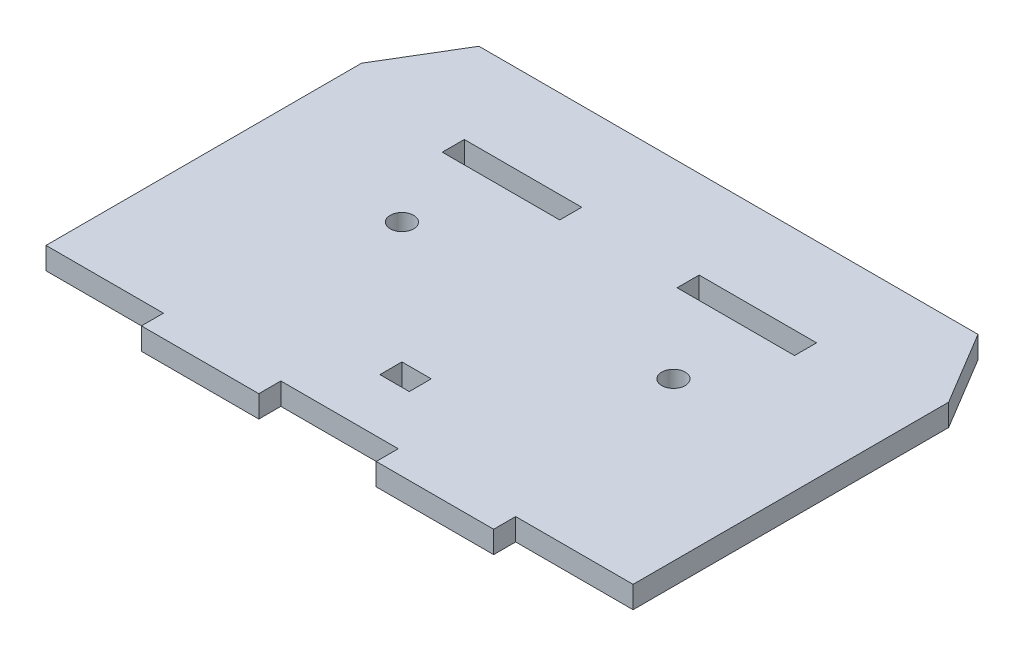
ISO-10303-21;
HEADER;
FILE_DESCRIPTION(('STEP AP214'),'2;1');
FILE_NAME('part.step','',(''),(''),'','','');
FILE_SCHEMA(('AUTOMOTIVE_DESIGN { 1 0 10303 214 1 1 1 1 }'));
ENDSEC;
DATA;
#1=APPLICATION_CONTEXT('core data for automotive mechanical design processes');
#2=APPLICATION_PROTOCOL_DEFINITION('international standard','automotive_design',2000,#1);
#3=PRODUCT_CONTEXT('',#1,'mechanical');
#4=PRODUCT('Part','Part','',(#3));
#5=PRODUCT_RELATED_PRODUCT_CATEGORY('part','',(#4));
#6=PRODUCT_DEFINITION_FORMATION('','',#4);
#7=PRODUCT_DEFINITION_CONTEXT('part definition',#1,'design');
#8=PRODUCT_DEFINITION('design','',#6,#7);
#9=PRODUCT_DEFINITION_SHAPE('','',#8);
#10=(LENGTH_UNIT() NAMED_UNIT(*) SI_UNIT(.MILLI.,.METRE.));
#11=(NAMED_UNIT(*) PLANE_ANGLE_UNIT() SI_UNIT($,.RADIAN.));
#12=(NAMED_UNIT(*) SI_UNIT($,.STERADIAN.) SOLID_ANGLE_UNIT());
#13=UNCERTAINTY_MEASURE_WITH_UNIT(LENGTH_MEASURE(1.E-05),#10,'distance_accuracy_value','');
#14=(GEOMETRIC_REPRESENTATION_CONTEXT(3) GLOBAL_UNCERTAINTY_ASSIGNED_CONTEXT((#13)) GLOBAL_UNIT_ASSIGNED_CONTEXT((#10,
#11,#12)) REPRESENTATION_CONTEXT('',''));
#15=CARTESIAN_POINT('',(0.,0.,0.));
#16=DIRECTION('',(0.,0.,1.));
#17=DIRECTION('',(1.,0.,0.));
#18=AXIS2_PLACEMENT_3D('',#15,#16,#17);
#19=CARTESIAN_POINT('',(-34.,3.,-47.));
#20=DIRECTION('',(0.,0.,1.));
#21=DIRECTION('',(1.,0.,0.));
#22=AXIS2_PLACEMENT_3D('',#19,#20,#21);
#23=PLANE('',#22);
#24=DIRECTION('',(-1.,0.,0.));
#25=VECTOR('',#24,1.);
#26=CARTESIAN_POINT('',(-34.,0.,-47.));
#27=LINE('',#26,#25);
#28=CARTESIAN_POINT('',(34.,0.,-47.));
#29=VERTEX_POINT('',#28);
#30=CARTESIAN_POINT('',(-34.,0.,-47.));
#31=VERTEX_POINT('',#30);
#32=EDGE_CURVE('E242',#29,#31,#27,.T.);
#33=ORIENTED_EDGE('',*,*,#32,.T.);
#34=DIRECTION('',(0.,-1.,0.));
#35=VECTOR('',#34,1.);
#36=CARTESIAN_POINT('',(-34.,3.,-47.));
#37=LINE('',#36,#35);
#38=CARTESIAN_POINT('',(-34.,3.,-47.));
#39=VERTEX_POINT('',#38);
#40=EDGE_CURVE('E11',#39,#31,#37,.T.);
#41=ORIENTED_EDGE('',*,*,#40,.F.);
#42=DIRECTION('',(-1.,0.,0.));
#43=VECTOR('',#42,1.);
#44=CARTESIAN_POINT('',(-34.,3.,-47.));
#45=LINE('',#44,#43);
#46=CARTESIAN_POINT('',(34.,3.,-47.));
#47=VERTEX_POINT('',#46);
#48=EDGE_CURVE('E319',#47,#39,#45,.T.);
#49=ORIENTED_EDGE('',*,*,#48,.F.);
#50=DIRECTION('',(0.,-1.,0.));
#51=VECTOR('',#50,1.);
#52=CARTESIAN_POINT('',(34.,3.,-47.));
#53=LINE('',#52,#51);
#54=EDGE_CURVE('E349',#47,#29,#53,.T.);
#55=ORIENTED_EDGE('',*,*,#54,.T.);
#56=EDGE_LOOP('',(#33,#41,#49,#55));
#57=FACE_BOUND('',#56,.T.);
#58=ADVANCED_FACE('F33',(#57),#23,.F.);
#59=CARTESIAN_POINT('',(-40.,3.,-37.));
#60=DIRECTION('',(0.857492925712545,0.,0.514495755427526));
#61=DIRECTION('',(0.514495755427526,0.,-0.857492925712545));
#62=AXIS2_PLACEMENT_3D('',#59,#60,#61);
#63=PLANE('',#62);
#64=DIRECTION('',(-0.514495755427526,0.,0.857492925712544));
#65=VECTOR('',#64,1.);
#66=CARTESIAN_POINT('',(-40.,0.,-37.));
#67=LINE('',#66,#65);
#68=CARTESIAN_POINT('',(-40.,0.,-37.));
#69=VERTEX_POINT('',#68);
#70=EDGE_CURVE('E352',#31,#69,#67,.T.);
#71=ORIENTED_EDGE('',*,*,#70,.T.);
#72=DIRECTION('',(0.,-1.,0.));
#73=VECTOR('',#72,1.);
#74=CARTESIAN_POINT('',(-40.,3.,-37.));
#75=LINE('',#74,#73);
#76=CARTESIAN_POINT('',(-40.,3.,-37.));
#77=VERTEX_POINT('',#76);
#78=EDGE_CURVE('E40',#77,#69,#75,.T.);
#79=ORIENTED_EDGE('',*,*,#78,.F.);
#80=DIRECTION('',(-0.514495755427526,0.,0.857492925712544));
#81=VECTOR('',#80,1.);
#82=CARTESIAN_POINT('',(-40.,3.,-37.));
#83=LINE('',#82,#81);
#84=EDGE_CURVE('E322',#39,#77,#83,.T.);
#85=ORIENTED_EDGE('',*,*,#84,.F.);
#86=ORIENTED_EDGE('',*,*,#40,.T.);
#87=EDGE_LOOP('',(#71,#79,#85,#86));
#88=FACE_BOUND('',#87,.T.);
#89=ADVANCED_FACE('F438',(#88),#63,.F.);
#90=CARTESIAN_POINT('',(-40.,3.,-37.));
#91=DIRECTION('',(1.,0.,0.));
#92=DIRECTION('',(0.,0.,-1.));
#93=AXIS2_PLACEMENT_3D('',#90,#91,#92);
#94=PLANE('',#93);
#95=DIRECTION('',(0.,0.,1.));
#96=VECTOR('',#95,1.);
#97=CARTESIAN_POINT('',(-40.,0.,-37.));
#98=LINE('',#97,#96);
#99=CARTESIAN_POINT('',(-40.,0.,6.));
#100=VERTEX_POINT('',#99);
#101=EDGE_CURVE('E354',#69,#100,#98,.T.);
#102=ORIENTED_EDGE('',*,*,#101,.T.);
#103=DIRECTION('',(0.,-1.,0.));
#104=VECTOR('',#103,1.);
#105=CARTESIAN_POINT('',(-40.,3.,6.));
#106=LINE('',#105,#104);
#107=CARTESIAN_POINT('',(-40.,3.,6.));
#108=VERTEX_POINT('',#107);
#109=EDGE_CURVE('E409',#108,#100,#106,.T.);
#110=ORIENTED_EDGE('',*,*,#109,.F.);
#111=DIRECTION('',(0.,0.,1.));
#112=VECTOR('',#111,1.);
#113=CARTESIAN_POINT('',(-40.,3.,-37.));
#114=LINE('',#113,#112);
#115=EDGE_CURVE('E325',#77,#108,#114,.T.);
#116=ORIENTED_EDGE('',*,*,#115,.F.);
#117=ORIENTED_EDGE('',*,*,#78,.T.);
#118=EDGE_LOOP('',(#102,#110,#116,#117));
#119=FACE_BOUND('',#118,.T.);
#120=ADVANCED_FACE('F416',(#119),#94,.F.);
#121=CARTESIAN_POINT('',(-40.,3.,6.));
#122=DIRECTION('',(0.,0.,-1.));
#123=DIRECTION('',(-1.,0.,0.));
#124=AXIS2_PLACEMENT_3D('',#121,#122,#123);
#125=PLANE('',#124);
#126=DIRECTION('',(1.,0.,0.));
#127=VECTOR('',#126,1.);
#128=CARTESIAN_POINT('',(-40.,0.,6.));
#129=LINE('',#128,#127);
#130=CARTESIAN_POINT('',(-24.,0.,6.));
#131=VERTEX_POINT('',#130);
#132=EDGE_CURVE('E356',#100,#131,#129,.T.);
#133=ORIENTED_EDGE('',*,*,#132,.T.);
#134=DIRECTION('',(0.,-1.,0.));
#135=VECTOR('',#134,1.);
#136=CARTESIAN_POINT('',(-24.,3.,6.));
#137=LINE('',#136,#135);
#138=CARTESIAN_POINT('',(-24.,3.,6.));
#139=VERTEX_POINT('',#138);
#140=EDGE_CURVE('E406',#139,#131,#137,.T.);
#141=ORIENTED_EDGE('',*,*,#140,.F.);
#142=DIRECTION('',(1.,0.,0.));
#143=VECTOR('',#142,1.);
#144=CARTESIAN_POINT('',(-40.,3.,6.));
#145=LINE('',#144,#143);
#146=EDGE_CURVE('E327',#108,#139,#145,.T.);
#147=ORIENTED_EDGE('',*,*,#146,.F.);
#148=ORIENTED_EDGE('',*,*,#109,.T.);
#149=EDGE_LOOP('',(#133,#141,#147,#148));
#150=FACE_BOUND('',#149,.T.);
#151=ADVANCED_FACE('F426',(#150),#125,.F.);
#152=CARTESIAN_POINT('',(-24.,3.,6.));
#153=DIRECTION('',(1.,0.,0.));
#154=DIRECTION('',(0.,0.,-1.));
#155=AXIS2_PLACEMENT_3D('',#152,#153,#154);
#156=PLANE('',#155);
#157=DIRECTION('',(0.,0.,1.));
#158=VECTOR('',#157,1.);
#159=CARTESIAN_POINT('',(-24.,0.,6.));
#160=LINE('',#159,#158);
#161=CARTESIAN_POINT('',(-24.,0.,9.));
#162=VERTEX_POINT('',#161);
#163=EDGE_CURVE('E358',#131,#162,#160,.T.);
#164=ORIENTED_EDGE('',*,*,#163,.T.);
#165=DIRECTION('',(0.,-1.,0.));
#166=VECTOR('',#165,1.);
#167=CARTESIAN_POINT('',(-24.,3.,9.));
#168=LINE('',#167,#166);
#169=CARTESIAN_POINT('',(-24.,3.,9.));
#170=VERTEX_POINT('',#169);
#171=EDGE_CURVE('E403',#170,#162,#168,.T.);
#172=ORIENTED_EDGE('',*,*,#171,.F.);
#173=DIRECTION('',(0.,0.,1.));
#174=VECTOR('',#173,1.);
#175=CARTESIAN_POINT('',(-24.,3.,6.));
#176=LINE('',#175,#174);
#177=EDGE_CURVE('E329',#139,#170,#176,.T.);
#178=ORIENTED_EDGE('',*,*,#177,.F.);
#179=ORIENTED_EDGE('',*,*,#140,.T.);
#180=EDGE_LOOP('',(#164,#172,#178,#179));
#181=FACE_BOUND('',#180,.T.);
#182=ADVANCED_FACE('F430',(#181),#156,.F.);
#183=CARTESIAN_POINT('',(-24.,3.,9.));
#184=DIRECTION('',(0.,0.,-1.));
#185=DIRECTION('',(-1.,0.,0.));
#186=AXIS2_PLACEMENT_3D('',#183,#184,#185);
#187=PLANE('',#186);
#188=DIRECTION('',(1.,0.,0.));
#189=VECTOR('',#188,1.);
#190=CARTESIAN_POINT('',(-24.,0.,9.));
#191=LINE('',#190,#189);
#192=CARTESIAN_POINT('',(-8.,0.,8.99999999999999));
#193=VERTEX_POINT('',#192);
#194=EDGE_CURVE('E360',#162,#193,#191,.T.);
#195=ORIENTED_EDGE('',*,*,#194,.T.);
#196=DIRECTION('',(0.,-1.,0.));
#197=VECTOR('',#196,1.);
#198=CARTESIAN_POINT('',(-8.,3.,8.99999999999999));
#199=LINE('',#198,#197);
#200=CARTESIAN_POINT('',(-8.,3.,8.99999999999999));
#201=VERTEX_POINT('',#200);
#202=EDGE_CURVE('E400',#201,#193,#199,.T.);
#203=ORIENTED_EDGE('',*,*,#202,.F.);
#204=DIRECTION('',(1.,0.,0.));
#205=VECTOR('',#204,1.);
#206=CARTESIAN_POINT('',(-24.,3.,9.));
#207=LINE('',#206,#205);
#208=EDGE_CURVE('E331',#170,#201,#207,.T.);
#209=ORIENTED_EDGE('',*,*,#208,.F.);
#210=ORIENTED_EDGE('',*,*,#171,.T.);
#211=EDGE_LOOP('',(#195,#203,#209,#210));
#212=FACE_BOUND('',#211,.T.);
#213=ADVANCED_FACE('F481',(#212),#187,.F.);
#214=CARTESIAN_POINT('',(-8.,3.,8.99999999999999));
#215=DIRECTION('',(-1.,0.,0.));
#216=DIRECTION('',(0.,0.,1.));
#217=AXIS2_PLACEMENT_3D('',#214,#215,#216);
#218=PLANE('',#217);
#219=DIRECTION('',(0.,0.,-1.));
#220=VECTOR('',#219,1.);
#221=CARTESIAN_POINT('',(-8.,0.,8.99999999999999));
#222=LINE('',#221,#220);
#223=CARTESIAN_POINT('',(-8.,0.,6.));
#224=VERTEX_POINT('',#223);
#225=EDGE_CURVE('E362',#193,#224,#222,.T.);
#226=ORIENTED_EDGE('',*,*,#225,.T.);
#227=DIRECTION('',(0.,-1.,0.));
#228=VECTOR('',#227,1.);
#229=CARTESIAN_POINT('',(-8.,3.,6.));
#230=LINE('',#229,#228);
#231=CARTESIAN_POINT('',(-8.,3.,6.));
#232=VERTEX_POINT('',#231);
#233=EDGE_CURVE('E397',#232,#224,#230,.T.);
#234=ORIENTED_EDGE('',*,*,#233,.F.);
#235=DIRECTION('',(0.,0.,-1.));
#236=VECTOR('',#235,1.);
#237=CARTESIAN_POINT('',(-8.,3.,8.99999999999999));
#238=LINE('',#237,#236);
#239=EDGE_CURVE('E333',#201,#232,#238,.T.);
#240=ORIENTED_EDGE('',*,*,#239,.F.);
#241=ORIENTED_EDGE('',*,*,#202,.T.);
#242=EDGE_LOOP('',(#226,#234,#240,#241));
#243=FACE_BOUND('',#242,.T.);
#244=ADVANCED_FACE('F479',(#243),#218,.F.);
#245=CARTESIAN_POINT('',(-8.,3.,6.));
#246=DIRECTION('',(0.,0.,-1.));
#247=DIRECTION('',(-1.,0.,0.));
#248=AXIS2_PLACEMENT_3D('',#245,#246,#247);
#249=PLANE('',#248);
#250=DIRECTION('',(1.,0.,0.));
#251=VECTOR('',#250,1.);
#252=CARTESIAN_POINT('',(-8.,0.,6.));
#253=LINE('',#252,#251);
#254=CARTESIAN_POINT('',(8.,0.,6.));
#255=VERTEX_POINT('',#254);
#256=EDGE_CURVE('E364',#224,#255,#253,.T.);
#257=ORIENTED_EDGE('',*,*,#256,.T.);
#258=DIRECTION('',(0.,-1.,0.));
#259=VECTOR('',#258,1.);
#260=CARTESIAN_POINT('',(8.,3.,6.));
#261=LINE('',#260,#259);
#262=CARTESIAN_POINT('',(8.,3.,6.));
#263=VERTEX_POINT('',#262);
#264=EDGE_CURVE('E394',#263,#255,#261,.T.);
#265=ORIENTED_EDGE('',*,*,#264,.F.);
#266=DIRECTION('',(1.,0.,0.));
#267=VECTOR('',#266,1.);
#268=CARTESIAN_POINT('',(-8.,3.,6.));
#269=LINE('',#268,#267);
#270=EDGE_CURVE('E335',#232,#263,#269,.T.);
#271=ORIENTED_EDGE('',*,*,#270,.F.);
#272=ORIENTED_EDGE('',*,*,#233,.T.);
#273=EDGE_LOOP('',(#257,#265,#271,#272));
#274=FACE_BOUND('',#273,.T.);
#275=ADVANCED_FACE('F474',(#274),#249,.F.);
#276=CARTESIAN_POINT('',(8.,3.,6.));
#277=DIRECTION('',(1.,0.,0.));
#278=DIRECTION('',(0.,0.,-1.));
#279=AXIS2_PLACEMENT_3D('',#276,#277,#278);
#280=PLANE('',#279);
#281=DIRECTION('',(0.,0.,1.));
#282=VECTOR('',#281,1.);
#283=CARTESIAN_POINT('',(8.,0.,6.));
#284=LINE('',#283,#282);
#285=CARTESIAN_POINT('',(8.,0.,9.));
#286=VERTEX_POINT('',#285);
#287=EDGE_CURVE('E366',#255,#286,#284,.T.);
#288=ORIENTED_EDGE('',*,*,#287,.T.);
#289=DIRECTION('',(0.,-1.,0.));
#290=VECTOR('',#289,1.);
#291=CARTESIAN_POINT('',(8.,3.,9.));
#292=LINE('',#291,#290);
#293=CARTESIAN_POINT('',(8.,3.,9.));
#294=VERTEX_POINT('',#293);
#295=EDGE_CURVE('E391',#294,#286,#292,.T.);
#296=ORIENTED_EDGE('',*,*,#295,.F.);
#297=DIRECTION('',(0.,0.,1.));
#298=VECTOR('',#297,1.);
#299=CARTESIAN_POINT('',(8.,3.,6.));
#300=LINE('',#299,#298);
#301=EDGE_CURVE('E337',#263,#294,#300,.T.);
#302=ORIENTED_EDGE('',*,*,#301,.F.);
#303=ORIENTED_EDGE('',*,*,#264,.T.);
#304=EDGE_LOOP('',(#288,#296,#302,#303));
#305=FACE_BOUND('',#304,.T.);
#306=ADVANCED_FACE('F469',(#305),#280,.F.);
#307=CARTESIAN_POINT('',(8.,3.,9.));
#308=DIRECTION('',(0.,0.,-1.));
#309=DIRECTION('',(-1.,0.,0.));
#310=AXIS2_PLACEMENT_3D('',#307,#308,#309);
#311=PLANE('',#310);
#312=DIRECTION('',(1.,0.,0.));
#313=VECTOR('',#312,1.);
#314=CARTESIAN_POINT('',(8.,0.,9.));
#315=LINE('',#314,#313);
#316=CARTESIAN_POINT('',(24.,0.,8.99999999999999));
#317=VERTEX_POINT('',#316);
#318=EDGE_CURVE('E368',#286,#317,#315,.T.);
#319=ORIENTED_EDGE('',*,*,#318,.T.);
#320=DIRECTION('',(0.,-1.,0.));
#321=VECTOR('',#320,1.);
#322=CARTESIAN_POINT('',(24.,3.,8.99999999999999));
#323=LINE('',#322,#321);
#324=CARTESIAN_POINT('',(24.,3.,8.99999999999999));
#325=VERTEX_POINT('',#324);
#326=EDGE_CURVE('E388',#325,#317,#323,.T.);
#327=ORIENTED_EDGE('',*,*,#326,.F.);
#328=DIRECTION('',(1.,0.,0.));
#329=VECTOR('',#328,1.);
#330=CARTESIAN_POINT('',(8.,3.,9.));
#331=LINE('',#330,#329);
#332=EDGE_CURVE('E339',#294,#325,#331,.T.);
#333=ORIENTED_EDGE('',*,*,#332,.F.);
#334=ORIENTED_EDGE('',*,*,#295,.T.);
#335=EDGE_LOOP('',(#319,#327,#333,#334));
#336=FACE_BOUND('',#335,.T.);
#337=ADVANCED_FACE('F465',(#336),#311,.F.);
#338=CARTESIAN_POINT('',(24.,3.,8.99999999999999));
#339=DIRECTION('',(-1.,0.,0.));
#340=DIRECTION('',(0.,0.,1.));
#341=AXIS2_PLACEMENT_3D('',#338,#339,#340);
#342=PLANE('',#341);
#343=DIRECTION('',(0.,0.,-1.));
#344=VECTOR('',#343,1.);
#345=CARTESIAN_POINT('',(24.,0.,8.99999999999999));
#346=LINE('',#345,#344);
#347=CARTESIAN_POINT('',(24.,0.,6.));
#348=VERTEX_POINT('',#347);
#349=EDGE_CURVE('E370',#317,#348,#346,.T.);
#350=ORIENTED_EDGE('',*,*,#349,.T.);
#351=DIRECTION('',(0.,-1.,0.));
#352=VECTOR('',#351,1.);
#353=CARTESIAN_POINT('',(24.,3.,6.));
#354=LINE('',#353,#352);
#355=CARTESIAN_POINT('',(24.,3.,6.));
#356=VERTEX_POINT('',#355);
#357=EDGE_CURVE('E385',#356,#348,#354,.T.);
#358=ORIENTED_EDGE('',*,*,#357,.F.);
#359=DIRECTION('',(0.,0.,-1.));
#360=VECTOR('',#359,1.);
#361=CARTESIAN_POINT('',(24.,3.,8.99999999999999));
#362=LINE('',#361,#360);
#363=EDGE_CURVE('E341',#325,#356,#362,.T.);
#364=ORIENTED_EDGE('',*,*,#363,.F.);
#365=ORIENTED_EDGE('',*,*,#326,.T.);
#366=EDGE_LOOP('',(#350,#358,#364,#365));
#367=FACE_BOUND('',#366,.T.);
#368=ADVANCED_FACE('F460',(#367),#342,.F.);
#369=CARTESIAN_POINT('',(24.,3.,6.));
#370=DIRECTION('',(0.,0.,-1.));
#371=DIRECTION('',(-1.,0.,0.));
#372=AXIS2_PLACEMENT_3D('',#369,#370,#371);
#373=PLANE('',#372);
#374=DIRECTION('',(1.,0.,0.));
#375=VECTOR('',#374,1.);
#376=CARTESIAN_POINT('',(24.,0.,6.));
#377=LINE('',#376,#375);
#378=CARTESIAN_POINT('',(40.,0.,6.));
#379=VERTEX_POINT('',#378);
#380=EDGE_CURVE('E372',#348,#379,#377,.T.);
#381=ORIENTED_EDGE('',*,*,#380,.T.);
#382=DIRECTION('',(0.,-1.,0.));
#383=VECTOR('',#382,1.);
#384=CARTESIAN_POINT('',(40.,3.,6.));
#385=LINE('',#384,#383);
#386=CARTESIAN_POINT('',(40.,3.,6.));
#387=VERTEX_POINT('',#386);
#388=EDGE_CURVE('E382',#387,#379,#385,.T.);
#389=ORIENTED_EDGE('',*,*,#388,.F.);
#390=DIRECTION('',(1.,0.,0.));
#391=VECTOR('',#390,1.);
#392=CARTESIAN_POINT('',(24.,3.,6.));
#393=LINE('',#392,#391);
#394=EDGE_CURVE('E343',#356,#387,#393,.T.);
#395=ORIENTED_EDGE('',*,*,#394,.F.);
#396=ORIENTED_EDGE('',*,*,#357,.T.);
#397=EDGE_LOOP('',(#381,#389,#395,#396));
#398=FACE_BOUND('',#397,.T.);
#399=ADVANCED_FACE('F454',(#398),#373,.F.);
#400=CARTESIAN_POINT('',(40.,3.,-37.));
#401=DIRECTION('',(-1.,0.,0.));
#402=DIRECTION('',(0.,0.,1.));
#403=AXIS2_PLACEMENT_3D('',#400,#401,#402);
#404=PLANE('',#403);
#405=DIRECTION('',(0.,0.,-1.));
#406=VECTOR('',#405,1.);
#407=CARTESIAN_POINT('',(40.,0.,-37.));
#408=LINE('',#407,#406);
#409=CARTESIAN_POINT('',(40.,0.,-37.));
#410=VERTEX_POINT('',#409);
#411=EDGE_CURVE('E374',#379,#410,#408,.T.);
#412=ORIENTED_EDGE('',*,*,#411,.T.);
#413=DIRECTION('',(0.,-1.,0.));
#414=VECTOR('',#413,1.);
#415=CARTESIAN_POINT('',(40.,3.,-37.));
#416=LINE('',#415,#414);
#417=CARTESIAN_POINT('',(40.,3.,-37.));
#418=VERTEX_POINT('',#417);
#419=EDGE_CURVE('E379',#418,#410,#416,.T.);
#420=ORIENTED_EDGE('',*,*,#419,.F.);
#421=DIRECTION('',(0.,0.,-1.));
#422=VECTOR('',#421,1.);
#423=CARTESIAN_POINT('',(40.,3.,-37.));
#424=LINE('',#423,#422);
#425=EDGE_CURVE('E345',#387,#418,#424,.T.);
#426=ORIENTED_EDGE('',*,*,#425,.F.);
#427=ORIENTED_EDGE('',*,*,#388,.T.);
#428=EDGE_LOOP('',(#412,#420,#426,#427));
#429=FACE_BOUND('',#428,.T.);
#430=ADVANCED_FACE('F450',(#429),#404,.F.);
#431=CARTESIAN_POINT('',(34.,3.,-47.));
#432=DIRECTION('',(-0.857492925712545,0.,0.514495755427526));
#433=DIRECTION('',(0.514495755427526,0.,0.857492925712545));
#434=AXIS2_PLACEMENT_3D('',#431,#432,#433);
#435=PLANE('',#434);
#436=DIRECTION('',(-0.514495755427526,0.,-0.857492925712544));
#437=VECTOR('',#436,1.);
#438=CARTESIAN_POINT('',(34.,0.,-47.));
#439=LINE('',#438,#437);
#440=EDGE_CURVE('E323',#410,#29,#439,.T.);
#441=ORIENTED_EDGE('',*,*,#440,.T.);
#442=ORIENTED_EDGE('',*,*,#54,.F.);
#443=DIRECTION('',(-0.514495755427526,0.,-0.857492925712544));
#444=VECTOR('',#443,1.);
#445=CARTESIAN_POINT('',(34.,3.,-47.));
#446=LINE('',#445,#444);
#447=EDGE_CURVE('E347',#418,#47,#446,.T.);
#448=ORIENTED_EDGE('',*,*,#447,.F.);
#449=ORIENTED_EDGE('',*,*,#419,.T.);
#450=EDGE_LOOP('',(#441,#442,#448,#449));
#451=FACE_BOUND('',#450,.T.);
#452=ADVANCED_FACE('F445',(#451),#435,.F.);
#453=CARTESIAN_POINT('',(0.,3.,0.));
#454=DIRECTION('',(0.,-1.,0.));
#455=DIRECTION('',(0.,0.,-1.));
#456=AXIS2_PLACEMENT_3D('',#453,#454,#455);
#457=PLANE('',#456);
#458=DIRECTION('',(-1.,0.,0.));
#459=VECTOR('',#458,1.);
#460=CARTESIAN_POINT('',(-2.,3.,-4.50000000000001));
#461=LINE('',#460,#459);
#462=CARTESIAN_POINT('',(2.,3.,-4.50000000000001));
#463=VERTEX_POINT('',#462);
#464=CARTESIAN_POINT('',(-2.,3.,-4.50000000000001));
#465=VERTEX_POINT('',#464);
#466=EDGE_CURVE('E235',#463,#465,#461,.T.);
#467=ORIENTED_EDGE('',*,*,#466,.F.);
#468=DIRECTION('',(0.,0.,-1.));
#469=VECTOR('',#468,1.);
#470=CARTESIAN_POINT('',(2.,3.,-4.50000000000001));
#471=LINE('',#470,#469);
#472=CARTESIAN_POINT('',(2.00000000000001,3.,-1.50000000000001));
#473=VERTEX_POINT('',#472);
#474=EDGE_CURVE('E47',#473,#463,#471,.T.);
#475=ORIENTED_EDGE('',*,*,#474,.F.);
#476=DIRECTION('',(1.,0.,0.));
#477=VECTOR('',#476,1.);
#478=CARTESIAN_POINT('',(-2.,3.,-1.50000000000001));
#479=LINE('',#478,#477);
#480=CARTESIAN_POINT('',(-2.,3.,-1.50000000000001));
#481=VERTEX_POINT('',#480);
#482=EDGE_CURVE('E226',#481,#473,#479,.T.);
#483=ORIENTED_EDGE('',*,*,#482,.F.);
#484=DIRECTION('',(0.,0.,1.));
#485=VECTOR('',#484,1.);
#486=CARTESIAN_POINT('',(-2.,3.,-4.50000000000001));
#487=LINE('',#486,#485);
#488=EDGE_CURVE('E229',#465,#481,#487,.T.);
#489=ORIENTED_EDGE('',*,*,#488,.F.);
#490=EDGE_LOOP('',(#467,#475,#483,#489));
#491=FACE_BOUND('',#490,.T.);
#492=CARTESIAN_POINT('',(-18.5,3.,-21.));
#493=DIRECTION('',(0.,1.,0.));
#494=DIRECTION('',(0.,0.,1.));
#495=AXIS2_PLACEMENT_3D('',#492,#493,#494);
#496=CIRCLE('',#495,1.6);
#497=CARTESIAN_POINT('',(-18.5,3.,-19.4));
#498=VERTEX_POINT('',#497);
#499=EDGE_CURVE('E248',#498,#498,#496,.T.);
#500=ORIENTED_EDGE('',*,*,#499,.F.);
#501=EDGE_LOOP('',(#500));
#502=FACE_BOUND('',#501,.T.);
#503=DIRECTION('',(-1.,0.,0.));
#504=VECTOR('',#503,1.);
#505=CARTESIAN_POINT('',(-8.00000000000001,3.,-35.));
#506=LINE('',#505,#504);
#507=CARTESIAN_POINT('',(-8.00000000000001,3.,-35.));
#508=VERTEX_POINT('',#507);
#509=CARTESIAN_POINT('',(-24.,3.,-35.));
#510=VERTEX_POINT('',#509);
#511=EDGE_CURVE('E267',#508,#510,#506,.T.);
#512=ORIENTED_EDGE('',*,*,#511,.F.);
#513=DIRECTION('',(0.,0.,-1.));
#514=VECTOR('',#513,1.);
#515=CARTESIAN_POINT('',(-8.00000000000001,3.,-32.));
#516=LINE('',#515,#514);
#517=CARTESIAN_POINT('',(-8.00000000000001,3.,-32.));
#518=VERTEX_POINT('',#517);
#519=EDGE_CURVE('E55',#518,#508,#516,.T.);
#520=ORIENTED_EDGE('',*,*,#519,.F.);
#521=DIRECTION('',(1.,0.,0.));
#522=VECTOR('',#521,1.);
#523=CARTESIAN_POINT('',(-24.,3.,-32.));
#524=LINE('',#523,#522);
#525=CARTESIAN_POINT('',(-24.,3.,-32.));
#526=VERTEX_POINT('',#525);
#527=EDGE_CURVE('E256',#526,#518,#524,.T.);
#528=ORIENTED_EDGE('',*,*,#527,.F.);
#529=DIRECTION('',(0.,0.,1.));
#530=VECTOR('',#529,1.);
#531=CARTESIAN_POINT('',(-24.,3.,-35.));
#532=LINE('',#531,#530);
#533=EDGE_CURVE('E271',#510,#526,#532,.T.);
#534=ORIENTED_EDGE('',*,*,#533,.F.);
#535=EDGE_LOOP('',(#512,#520,#528,#534));
#536=FACE_BOUND('',#535,.T.);
#537=CARTESIAN_POINT('',(18.5,3.,-21.));
#538=DIRECTION('',(0.,1.,0.));
#539=DIRECTION('',(0.,0.,1.));
#540=AXIS2_PLACEMENT_3D('',#537,#538,#539);
#541=CIRCLE('',#540,1.6);
#542=CARTESIAN_POINT('',(18.5,3.,-19.4));
#543=VERTEX_POINT('',#542);
#544=EDGE_CURVE('E284',#543,#543,#541,.T.);
#545=ORIENTED_EDGE('',*,*,#544,.F.);
#546=EDGE_LOOP('',(#545));
#547=FACE_BOUND('',#546,.T.);
#548=DIRECTION('',(0.,0.,-1.));
#549=VECTOR('',#548,1.);
#550=CARTESIAN_POINT('',(24.,3.,-35.));
#551=LINE('',#550,#549);
#552=CARTESIAN_POINT('',(24.,3.,-32.));
#553=VERTEX_POINT('',#552);
#554=CARTESIAN_POINT('',(24.,3.,-35.));
#555=VERTEX_POINT('',#554);
#556=EDGE_CURVE('E304',#553,#555,#551,.T.);
#557=ORIENTED_EDGE('',*,*,#556,.F.);
#558=DIRECTION('',(1.,0.,0.));
#559=VECTOR('',#558,1.);
#560=CARTESIAN_POINT('',(24.,3.,-32.));
#561=LINE('',#560,#559);
#562=CARTESIAN_POINT('',(7.99999999999999,3.,-32.));
#563=VERTEX_POINT('',#562);
#564=EDGE_CURVE('E302',#563,#553,#561,.T.);
#565=ORIENTED_EDGE('',*,*,#564,.F.);
#566=DIRECTION('',(0.,0.,1.));
#567=VECTOR('',#566,1.);
#568=CARTESIAN_POINT('',(7.99999999999999,3.,-32.));
#569=LINE('',#568,#567);
#570=CARTESIAN_POINT('',(7.99999999999999,3.,-35.));
#571=VERTEX_POINT('',#570);
#572=EDGE_CURVE('E292',#571,#563,#569,.T.);
#573=ORIENTED_EDGE('',*,*,#572,.F.);
#574=DIRECTION('',(-1.,0.,0.));
#575=VECTOR('',#574,1.);
#576=CARTESIAN_POINT('',(7.99999999999999,3.,-35.));
#577=LINE('',#576,#575);
#578=EDGE_CURVE('E307',#555,#571,#577,.T.);
#579=ORIENTED_EDGE('',*,*,#578,.F.);
#580=EDGE_LOOP('',(#557,#565,#573,#579));
#581=FACE_BOUND('',#580,.T.);
#582=ORIENTED_EDGE('',*,*,#48,.T.);
#583=ORIENTED_EDGE('',*,*,#84,.T.);
#584=ORIENTED_EDGE('',*,*,#115,.T.);
#585=ORIENTED_EDGE('',*,*,#146,.T.);
#586=ORIENTED_EDGE('',*,*,#177,.T.);
#587=ORIENTED_EDGE('',*,*,#208,.T.);
#588=ORIENTED_EDGE('',*,*,#239,.T.);
#589=ORIENTED_EDGE('',*,*,#270,.T.);
#590=ORIENTED_EDGE('',*,*,#301,.T.);
#591=ORIENTED_EDGE('',*,*,#332,.T.);
#592=ORIENTED_EDGE('',*,*,#363,.T.);
#593=ORIENTED_EDGE('',*,*,#394,.T.);
#594=ORIENTED_EDGE('',*,*,#425,.T.);
#595=ORIENTED_EDGE('',*,*,#447,.T.);
#596=EDGE_LOOP('',(#582,#583,#584,#585,#586,#587,#588,#589,#590,#591,#592,#593,#594,#595));
#597=FACE_BOUND('',#596,.T.);
#598=ADVANCED_FACE('F434',(#491,#502,#536,#547,#581,#597),#457,.F.);
#599=CARTESIAN_POINT('',(0.,0.,0.));
#600=DIRECTION('',(0.,-1.,0.));
#601=DIRECTION('',(0.,0.,-1.));
#602=AXIS2_PLACEMENT_3D('',#599,#600,#601);
#603=PLANE('',#602);
#604=DIRECTION('',(0.,0.,-1.));
#605=VECTOR('',#604,1.);
#606=CARTESIAN_POINT('',(2.,0.,-4.50000000000001));
#607=LINE('',#606,#605);
#608=CARTESIAN_POINT('',(2.00000000000001,0.,-1.50000000000001));
#609=VERTEX_POINT('',#608);
#610=CARTESIAN_POINT('',(2.,0.,-4.50000000000001));
#611=VERTEX_POINT('',#610);
#612=EDGE_CURVE('E207',#609,#611,#607,.T.);
#613=ORIENTED_EDGE('',*,*,#612,.T.);
#614=DIRECTION('',(-1.,0.,0.));
#615=VECTOR('',#614,1.);
#616=CARTESIAN_POINT('',(-2.,0.,-4.50000000000001));
#617=LINE('',#616,#615);
#618=CARTESIAN_POINT('',(-2.,0.,-4.50000000000001));
#619=VERTEX_POINT('',#618);
#620=EDGE_CURVE('E217',#611,#619,#617,.T.);
#621=ORIENTED_EDGE('',*,*,#620,.T.);
#622=DIRECTION('',(0.,0.,1.));
#623=VECTOR('',#622,1.);
#624=CARTESIAN_POINT('',(-2.,0.,-4.50000000000001));
#625=LINE('',#624,#623);
#626=CARTESIAN_POINT('',(-2.,0.,-1.50000000000001));
#627=VERTEX_POINT('',#626);
#628=EDGE_CURVE('E221',#619,#627,#625,.T.);
#629=ORIENTED_EDGE('',*,*,#628,.T.);
#630=DIRECTION('',(1.,0.,0.));
#631=VECTOR('',#630,1.);
#632=CARTESIAN_POINT('',(-2.,0.,-1.50000000000001));
#633=LINE('',#632,#631);
#634=EDGE_CURVE('E213',#627,#609,#633,.T.);
#635=ORIENTED_EDGE('',*,*,#634,.T.);
#636=EDGE_LOOP('',(#613,#621,#629,#635));
#637=FACE_BOUND('',#636,.T.);
#638=CARTESIAN_POINT('',(-18.5,0.,-21.));
#639=DIRECTION('',(0.,1.,0.));
#640=DIRECTION('',(0.,0.,1.));
#641=AXIS2_PLACEMENT_3D('',#638,#639,#640);
#642=CIRCLE('',#641,1.6);
#643=CARTESIAN_POINT('',(-18.5,0.,-19.4));
#644=VERTEX_POINT('',#643);
#645=EDGE_CURVE('E236',#644,#644,#642,.T.);
#646=ORIENTED_EDGE('',*,*,#645,.T.);
#647=EDGE_LOOP('',(#646));
#648=FACE_BOUND('',#647,.T.);
#649=DIRECTION('',(0.,0.,-1.));
#650=VECTOR('',#649,1.);
#651=CARTESIAN_POINT('',(-8.00000000000001,0.,-32.));
#652=LINE('',#651,#650);
#653=CARTESIAN_POINT('',(-8.00000000000001,0.,-32.));
#654=VERTEX_POINT('',#653);
#655=CARTESIAN_POINT('',(-8.00000000000001,0.,-35.));
#656=VERTEX_POINT('',#655);
#657=EDGE_CURVE('E252',#654,#656,#652,.T.);
#658=ORIENTED_EDGE('',*,*,#657,.T.);
#659=DIRECTION('',(-1.,0.,0.));
#660=VECTOR('',#659,1.);
#661=CARTESIAN_POINT('',(-8.00000000000001,0.,-35.));
#662=LINE('',#661,#660);
#663=CARTESIAN_POINT('',(-24.,0.,-35.));
#664=VERTEX_POINT('',#663);
#665=EDGE_CURVE('E255',#656,#664,#662,.T.);
#666=ORIENTED_EDGE('',*,*,#665,.T.);
#667=DIRECTION('',(0.,0.,1.));
#668=VECTOR('',#667,1.);
#669=CARTESIAN_POINT('',(-24.,0.,-35.));
#670=LINE('',#669,#668);
#671=CARTESIAN_POINT('',(-24.,0.,-32.));
#672=VERTEX_POINT('',#671);
#673=EDGE_CURVE('E259',#664,#672,#670,.T.);
#674=ORIENTED_EDGE('',*,*,#673,.T.);
#675=DIRECTION('',(1.,0.,0.));
#676=VECTOR('',#675,1.);
#677=CARTESIAN_POINT('',(-24.,0.,-32.));
#678=LINE('',#677,#676);
#679=EDGE_CURVE('E262',#672,#654,#678,.T.);
#680=ORIENTED_EDGE('',*,*,#679,.T.);
#681=EDGE_LOOP('',(#658,#666,#674,#680));
#682=FACE_BOUND('',#681,.T.);
#683=CARTESIAN_POINT('',(18.5,0.,-21.));
#684=DIRECTION('',(0.,1.,0.));
#685=DIRECTION('',(0.,0.,1.));
#686=AXIS2_PLACEMENT_3D('',#683,#684,#685);
#687=CIRCLE('',#686,1.6);
#688=CARTESIAN_POINT('',(18.5,0.,-19.4));
#689=VERTEX_POINT('',#688);
#690=EDGE_CURVE('E268',#689,#689,#687,.T.);
#691=ORIENTED_EDGE('',*,*,#690,.T.);
#692=EDGE_LOOP('',(#691));
#693=FACE_BOUND('',#692,.T.);
#694=DIRECTION('',(1.,0.,0.));
#695=VECTOR('',#694,1.);
#696=CARTESIAN_POINT('',(24.,0.,-32.));
#697=LINE('',#696,#695);
#698=CARTESIAN_POINT('',(7.99999999999999,0.,-32.));
#699=VERTEX_POINT('',#698);
#700=CARTESIAN_POINT('',(24.,0.,-32.));
#701=VERTEX_POINT('',#700);
#702=EDGE_CURVE('E288',#699,#701,#697,.T.);
#703=ORIENTED_EDGE('',*,*,#702,.T.);
#704=DIRECTION('',(0.,0.,-1.));
#705=VECTOR('',#704,1.);
#706=CARTESIAN_POINT('',(24.,0.,-35.));
#707=LINE('',#706,#705);
#708=CARTESIAN_POINT('',(24.,0.,-35.));
#709=VERTEX_POINT('',#708);
#710=EDGE_CURVE('E291',#701,#709,#707,.T.);
#711=ORIENTED_EDGE('',*,*,#710,.T.);
#712=DIRECTION('',(-1.,0.,0.));
#713=VECTOR('',#712,1.);
#714=CARTESIAN_POINT('',(7.99999999999999,0.,-35.));
#715=LINE('',#714,#713);
#716=CARTESIAN_POINT('',(7.99999999999999,0.,-35.));
#717=VERTEX_POINT('',#716);
#718=EDGE_CURVE('E295',#709,#717,#715,.T.);
#719=ORIENTED_EDGE('',*,*,#718,.T.);
#720=DIRECTION('',(0.,0.,1.));
#721=VECTOR('',#720,1.);
#722=CARTESIAN_POINT('',(7.99999999999999,0.,-32.));
#723=LINE('',#722,#721);
#724=EDGE_CURVE('E298',#717,#699,#723,.T.);
#725=ORIENTED_EDGE('',*,*,#724,.T.);
#726=EDGE_LOOP('',(#703,#711,#719,#725));
#727=FACE_BOUND('',#726,.T.);
#728=ORIENTED_EDGE('',*,*,#32,.F.);
#729=ORIENTED_EDGE('',*,*,#440,.F.);
#730=ORIENTED_EDGE('',*,*,#411,.F.);
#731=ORIENTED_EDGE('',*,*,#380,.F.);
#732=ORIENTED_EDGE('',*,*,#349,.F.);
#733=ORIENTED_EDGE('',*,*,#318,.F.);
#734=ORIENTED_EDGE('',*,*,#287,.F.);
#735=ORIENTED_EDGE('',*,*,#256,.F.);
#736=ORIENTED_EDGE('',*,*,#225,.F.);
#737=ORIENTED_EDGE('',*,*,#194,.F.);
#738=ORIENTED_EDGE('',*,*,#163,.F.);
#739=ORIENTED_EDGE('',*,*,#132,.F.);
#740=ORIENTED_EDGE('',*,*,#101,.F.);
#741=ORIENTED_EDGE('',*,*,#70,.F.);
#742=EDGE_LOOP('',(#728,#729,#730,#731,#732,#733,#734,#735,#736,#737,#738,#739,#740,#741));
#743=FACE_BOUND('',#742,.T.);
#744=ADVANCED_FACE('F223',(#637,#648,#682,#693,#727,#743),#603,.T.);
#745=CARTESIAN_POINT('',(24.,0.,-32.));
#746=DIRECTION('',(0.,0.,1.));
#747=DIRECTION('',(1.,0.,0.));
#748=AXIS2_PLACEMENT_3D('',#745,#746,#747);
#749=PLANE('',#748);
#750=ORIENTED_EDGE('',*,*,#564,.T.);
#751=DIRECTION('',(0.,1.,0.));
#752=VECTOR('',#751,1.);
#753=CARTESIAN_POINT('',(24.,0.,-32.));
#754=LINE('',#753,#752);
#755=EDGE_CURVE('E301',#701,#553,#754,.T.);
#756=ORIENTED_EDGE('',*,*,#755,.F.);
#757=ORIENTED_EDGE('',*,*,#702,.F.);
#758=DIRECTION('',(0.,1.,0.));
#759=VECTOR('',#758,1.);
#760=CARTESIAN_POINT('',(7.99999999999999,0.,-32.));
#761=LINE('',#760,#759);
#762=EDGE_CURVE('E287',#699,#563,#761,.T.);
#763=ORIENTED_EDGE('',*,*,#762,.T.);
#764=EDGE_LOOP('',(#750,#756,#757,#763));
#765=FACE_BOUND('',#764,.T.);
#766=ADVANCED_FACE('F592',(#765),#749,.F.);
#767=CARTESIAN_POINT('',(7.99999999999999,0.,-32.));
#768=DIRECTION('',(-1.,0.,0.));
#769=DIRECTION('',(0.,0.,1.));
#770=AXIS2_PLACEMENT_3D('',#767,#768,#769);
#771=PLANE('',#770);
#772=ORIENTED_EDGE('',*,*,#572,.T.);
#773=ORIENTED_EDGE('',*,*,#762,.F.);
#774=ORIENTED_EDGE('',*,*,#724,.F.);
#775=DIRECTION('',(0.,1.,0.));
#776=VECTOR('',#775,1.);
#777=CARTESIAN_POINT('',(7.99999999999999,0.,-35.));
#778=LINE('',#777,#776);
#779=EDGE_CURVE('E313',#717,#571,#778,.T.);
#780=ORIENTED_EDGE('',*,*,#779,.T.);
#781=EDGE_LOOP('',(#772,#773,#774,#780));
#782=FACE_BOUND('',#781,.T.);
#783=ADVANCED_FACE('F601',(#782),#771,.F.);
#784=CARTESIAN_POINT('',(7.99999999999999,0.,-35.));
#785=DIRECTION('',(0.,0.,-1.));
#786=DIRECTION('',(-1.,0.,0.));
#787=AXIS2_PLACEMENT_3D('',#784,#785,#786);
#788=PLANE('',#787);
#789=ORIENTED_EDGE('',*,*,#578,.T.);
#790=ORIENTED_EDGE('',*,*,#779,.F.);
#791=ORIENTED_EDGE('',*,*,#718,.F.);
#792=DIRECTION('',(0.,1.,0.));
#793=VECTOR('',#792,1.);
#794=CARTESIAN_POINT('',(24.,0.,-35.));
#795=LINE('',#794,#793);
#796=EDGE_CURVE('E315',#709,#555,#795,.T.);
#797=ORIENTED_EDGE('',*,*,#796,.T.);
#798=EDGE_LOOP('',(#789,#790,#791,#797));
#799=FACE_BOUND('',#798,.T.);
#800=ADVANCED_FACE('F611',(#799),#788,.F.);
#801=CARTESIAN_POINT('',(24.,0.,-35.));
#802=DIRECTION('',(1.,0.,0.));
#803=DIRECTION('',(0.,0.,-1.));
#804=AXIS2_PLACEMENT_3D('',#801,#802,#803);
#805=PLANE('',#804);
#806=ORIENTED_EDGE('',*,*,#556,.T.);
#807=ORIENTED_EDGE('',*,*,#796,.F.);
#808=ORIENTED_EDGE('',*,*,#710,.F.);
#809=ORIENTED_EDGE('',*,*,#755,.T.);
#810=EDGE_LOOP('',(#806,#807,#808,#809));
#811=FACE_BOUND('',#810,.T.);
#812=ADVANCED_FACE('F621',(#811),#805,.F.);
#813=CARTESIAN_POINT('',(18.5,0.,-21.));
#814=DIRECTION('',(0.,1.,0.));
#815=DIRECTION('',(0.,0.,1.));
#816=AXIS2_PLACEMENT_3D('',#813,#814,#815);
#817=CYLINDRICAL_SURFACE('',#816,1.6);
#818=ORIENTED_EDGE('',*,*,#690,.F.);
#819=EDGE_LOOP('',(#818));
#820=FACE_BOUND('',#819,.T.);
#821=ORIENTED_EDGE('',*,*,#544,.T.);
#822=EDGE_LOOP('',(#821));
#823=FACE_BOUND('',#822,.T.);
#824=ADVANCED_FACE('F631',(#820,#823),#817,.F.);
#825=CARTESIAN_POINT('',(-8.00000000000001,0.,-32.));
#826=DIRECTION('',(1.,0.,0.));
#827=DIRECTION('',(0.,0.,-1.));
#828=AXIS2_PLACEMENT_3D('',#825,#826,#827);
#829=PLANE('',#828);
#830=ORIENTED_EDGE('',*,*,#519,.T.);
#831=DIRECTION('',(0.,1.,0.));
#832=VECTOR('',#831,1.);
#833=CARTESIAN_POINT('',(-8.00000000000001,0.,-35.));
#834=LINE('',#833,#832);
#835=EDGE_CURVE('E265',#656,#508,#834,.T.);
#836=ORIENTED_EDGE('',*,*,#835,.F.);
#837=ORIENTED_EDGE('',*,*,#657,.F.);
#838=DIRECTION('',(0.,1.,0.));
#839=VECTOR('',#838,1.);
#840=CARTESIAN_POINT('',(-8.00000000000001,0.,-32.));
#841=LINE('',#840,#839);
#842=EDGE_CURVE('E251',#654,#518,#841,.T.);
#843=ORIENTED_EDGE('',*,*,#842,.T.);
#844=EDGE_LOOP('',(#830,#836,#837,#843));
#845=FACE_BOUND('',#844,.T.);
#846=ADVANCED_FACE('F641',(#845),#829,.F.);
#847=CARTESIAN_POINT('',(-24.,0.,-32.));
#848=DIRECTION('',(0.,0.,1.));
#849=DIRECTION('',(1.,0.,0.));
#850=AXIS2_PLACEMENT_3D('',#847,#848,#849);
#851=PLANE('',#850);
#852=ORIENTED_EDGE('',*,*,#527,.T.);
#853=ORIENTED_EDGE('',*,*,#842,.F.);
#854=ORIENTED_EDGE('',*,*,#679,.F.);
#855=DIRECTION('',(0.,1.,0.));
#856=VECTOR('',#855,1.);
#857=CARTESIAN_POINT('',(-24.,0.,-32.));
#858=LINE('',#857,#856);
#859=EDGE_CURVE('E277',#672,#526,#858,.T.);
#860=ORIENTED_EDGE('',*,*,#859,.T.);
#861=EDGE_LOOP('',(#852,#853,#854,#860));
#862=FACE_BOUND('',#861,.T.);
#863=ADVANCED_FACE('F651',(#862),#851,.F.);
#864=CARTESIAN_POINT('',(-24.,0.,-35.));
#865=DIRECTION('',(-1.,0.,0.));
#866=DIRECTION('',(0.,0.,1.));
#867=AXIS2_PLACEMENT_3D('',#864,#865,#866);
#868=PLANE('',#867);
#869=ORIENTED_EDGE('',*,*,#533,.T.);
#870=ORIENTED_EDGE('',*,*,#859,.F.);
#871=ORIENTED_EDGE('',*,*,#673,.F.);
#872=DIRECTION('',(0.,1.,0.));
#873=VECTOR('',#872,1.);
#874=CARTESIAN_POINT('',(-24.,0.,-35.));
#875=LINE('',#874,#873);
#876=EDGE_CURVE('E279',#664,#510,#875,.T.);
#877=ORIENTED_EDGE('',*,*,#876,.T.);
#878=EDGE_LOOP('',(#869,#870,#871,#877));
#879=FACE_BOUND('',#878,.T.);
#880=ADVANCED_FACE('F660',(#879),#868,.F.);
#881=CARTESIAN_POINT('',(-8.00000000000001,0.,-35.));
#882=DIRECTION('',(0.,0.,-1.));
#883=DIRECTION('',(-1.,0.,0.));
#884=AXIS2_PLACEMENT_3D('',#881,#882,#883);
#885=PLANE('',#884);
#886=ORIENTED_EDGE('',*,*,#511,.T.);
#887=ORIENTED_EDGE('',*,*,#876,.F.);
#888=ORIENTED_EDGE('',*,*,#665,.F.);
#889=ORIENTED_EDGE('',*,*,#835,.T.);
#890=EDGE_LOOP('',(#886,#887,#888,#889));
#891=FACE_BOUND('',#890,.T.);
#892=ADVANCED_FACE('F670',(#891),#885,.F.);
#893=CARTESIAN_POINT('',(-18.5,0.,-21.));
#894=DIRECTION('',(0.,1.,0.));
#895=DIRECTION('',(0.,0.,1.));
#896=AXIS2_PLACEMENT_3D('',#893,#894,#895);
#897=CYLINDRICAL_SURFACE('',#896,1.6);
#898=ORIENTED_EDGE('',*,*,#645,.F.);
#899=EDGE_LOOP('',(#898));
#900=FACE_BOUND('',#899,.T.);
#901=ORIENTED_EDGE('',*,*,#499,.T.);
#902=EDGE_LOOP('',(#901));
#903=FACE_BOUND('',#902,.T.);
#904=ADVANCED_FACE('F680',(#900,#903),#897,.F.);
#905=CARTESIAN_POINT('',(2.,0.,-4.50000000000001));
#906=DIRECTION('',(1.,0.,0.));
#907=DIRECTION('',(0.,0.,-1.));
#908=AXIS2_PLACEMENT_3D('',#905,#906,#907);
#909=PLANE('',#908);
#910=ORIENTED_EDGE('',*,*,#474,.T.);
#911=DIRECTION('',(0.,1.,0.));
#912=VECTOR('',#911,1.);
#913=CARTESIAN_POINT('',(2.,0.,-4.50000000000001));
#914=LINE('',#913,#912);
#915=EDGE_CURVE('E203',#611,#463,#914,.T.);
#916=ORIENTED_EDGE('',*,*,#915,.F.);
#917=ORIENTED_EDGE('',*,*,#612,.F.);
#918=DIRECTION('',(0.,1.,0.));
#919=VECTOR('',#918,1.);
#920=CARTESIAN_POINT('',(2.00000000000001,0.,-1.50000000000001));
#921=LINE('',#920,#919);
#922=EDGE_CURVE('E240',#609,#473,#921,.T.);
#923=ORIENTED_EDGE('',*,*,#922,.T.);
#924=EDGE_LOOP('',(#910,#916,#917,#923));
#925=FACE_BOUND('',#924,.T.);
#926=ADVANCED_FACE('F205',(#925),#909,.F.);
#927=CARTESIAN_POINT('',(-2.,0.,-1.50000000000001));
#928=DIRECTION('',(0.,0.,1.));
#929=DIRECTION('',(1.,0.,0.));
#930=AXIS2_PLACEMENT_3D('',#927,#928,#929);
#931=PLANE('',#930);
#932=ORIENTED_EDGE('',*,*,#482,.T.);
#933=ORIENTED_EDGE('',*,*,#922,.F.);
#934=ORIENTED_EDGE('',*,*,#634,.F.);
#935=DIRECTION('',(0.,1.,0.));
#936=VECTOR('',#935,1.);
#937=CARTESIAN_POINT('',(-2.,0.,-1.50000000000001));
#938=LINE('',#937,#936);
#939=EDGE_CURVE('E243',#627,#481,#938,.T.);
#940=ORIENTED_EDGE('',*,*,#939,.T.);
#941=EDGE_LOOP('',(#932,#933,#934,#940));
#942=FACE_BOUND('',#941,.T.);
#943=ADVANCED_FACE('F699',(#942),#931,.F.);
#944=CARTESIAN_POINT('',(-2.,0.,-4.50000000000001));
#945=DIRECTION('',(-1.,0.,0.));
#946=DIRECTION('',(0.,0.,1.));
#947=AXIS2_PLACEMENT_3D('',#944,#945,#946);
#948=PLANE('',#947);
#949=ORIENTED_EDGE('',*,*,#488,.T.);
#950=ORIENTED_EDGE('',*,*,#939,.F.);
#951=ORIENTED_EDGE('',*,*,#628,.F.);
#952=DIRECTION('',(0.,1.,0.));
#953=VECTOR('',#952,1.);
#954=CARTESIAN_POINT('',(-2.,0.,-4.50000000000001));
#955=LINE('',#954,#953);
#956=EDGE_CURVE('E212',#619,#465,#955,.T.);
#957=ORIENTED_EDGE('',*,*,#956,.T.);
#958=EDGE_LOOP('',(#949,#950,#951,#957));
#959=FACE_BOUND('',#958,.T.);
#960=ADVANCED_FACE('F708',(#959),#948,.F.);
#961=CARTESIAN_POINT('',(-2.,0.,-4.50000000000001));
#962=DIRECTION('',(0.,0.,-1.));
#963=DIRECTION('',(-1.,0.,0.));
#964=AXIS2_PLACEMENT_3D('',#961,#962,#963);
#965=PLANE('',#964);
#966=ORIENTED_EDGE('',*,*,#466,.T.);
#967=ORIENTED_EDGE('',*,*,#956,.F.);
#968=ORIENTED_EDGE('',*,*,#620,.F.);
#969=ORIENTED_EDGE('',*,*,#915,.T.);
#970=EDGE_LOOP('',(#966,#967,#968,#969));
#971=FACE_BOUND('',#970,.T.);
#972=ADVANCED_FACE('F218',(#971),#965,.F.);
#973=CLOSED_SHELL('',(#58,#89,#120,#151,#182,#213,#244,#275,#306,#337,#368,#399,#430,#452,#598,
#744,#766,#783,#800,#812,#824,#846,#863,#880,#892,#904,#926,#943,#960,#972));
#974=MANIFOLD_SOLID_BREP('B2',#973);
#975=ADVANCED_BREP_SHAPE_REPRESENTATION('',(#18,#974),#14);
#976=SHAPE_DEFINITION_REPRESENTATION(#9,#975);
ENDSEC;
END-ISO-10303-21;
